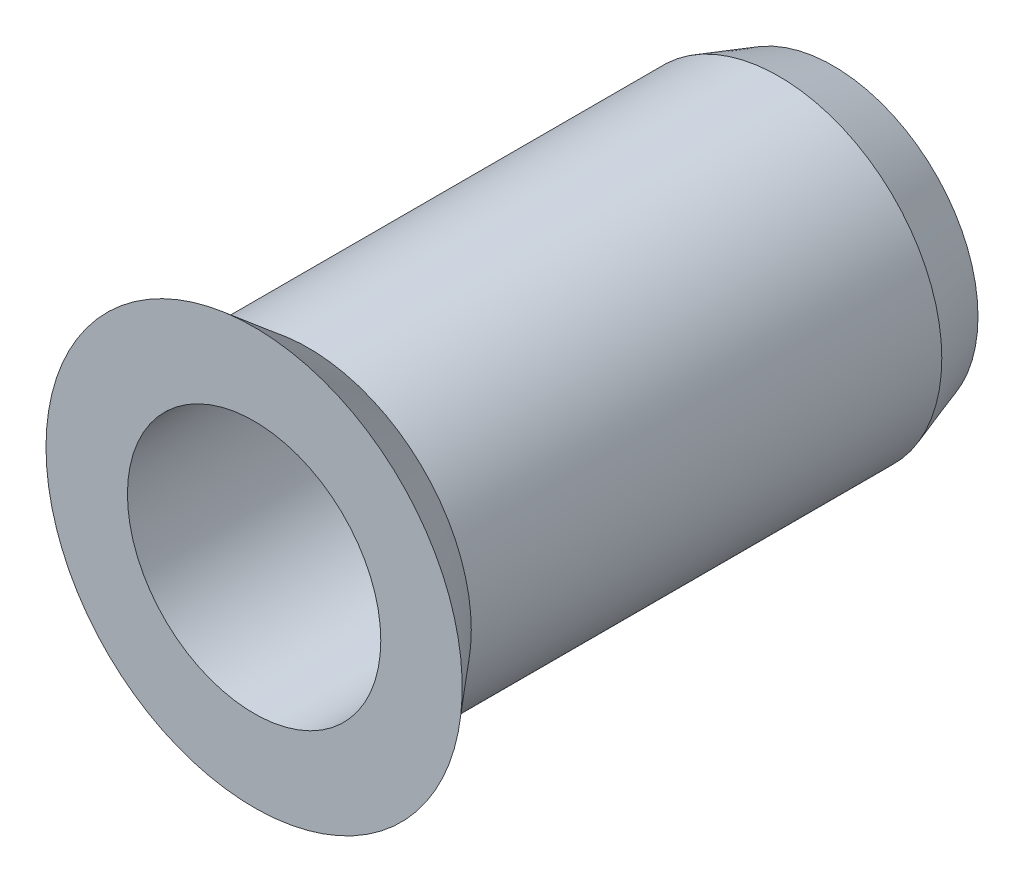
ISO-10303-21;
HEADER;
FILE_DESCRIPTION(('STEP AP214'),'2;1');
FILE_NAME('part.step','',(''),(''),'','','');
FILE_SCHEMA(('AUTOMOTIVE_DESIGN { 1 0 10303 214 1 1 1 1 }'));
ENDSEC;
DATA;
#1=APPLICATION_CONTEXT('core data for automotive mechanical design processes');
#2=APPLICATION_PROTOCOL_DEFINITION('international standard','automotive_design',2000,#1);
#3=PRODUCT_CONTEXT('',#1,'mechanical');
#4=PRODUCT('Part','Part','',(#3));
#5=PRODUCT_RELATED_PRODUCT_CATEGORY('part','',(#4));
#6=PRODUCT_DEFINITION_FORMATION('','',#4);
#7=PRODUCT_DEFINITION_CONTEXT('part definition',#1,'design');
#8=PRODUCT_DEFINITION('design','',#6,#7);
#9=PRODUCT_DEFINITION_SHAPE('','',#8);
#10=(LENGTH_UNIT() NAMED_UNIT(*) SI_UNIT(.MILLI.,.METRE.));
#11=(NAMED_UNIT(*) PLANE_ANGLE_UNIT() SI_UNIT($,.RADIAN.));
#12=(NAMED_UNIT(*) SI_UNIT($,.STERADIAN.) SOLID_ANGLE_UNIT());
#13=UNCERTAINTY_MEASURE_WITH_UNIT(LENGTH_MEASURE(1.E-05),#10,'distance_accuracy_value','');
#14=(GEOMETRIC_REPRESENTATION_CONTEXT(3) GLOBAL_UNCERTAINTY_ASSIGNED_CONTEXT((#13)) GLOBAL_UNIT_ASSIGNED_CONTEXT((#10,
#11,#12)) REPRESENTATION_CONTEXT('',''));
#15=CARTESIAN_POINT('',(0.,0.,0.));
#16=DIRECTION('',(0.,0.,1.));
#17=DIRECTION('',(1.,0.,0.));
#18=AXIS2_PLACEMENT_3D('',#15,#16,#17);
#19=CARTESIAN_POINT('',(0.,0.,16.0000000009859));
#20=DIRECTION('',(0.,0.,-1.));
#21=DIRECTION('',(-1.,0.,0.));
#22=AXIS2_PLACEMENT_3D('',#19,#20,#21);
#23=CYLINDRICAL_SURFACE('',#22,3.5);
#24=CARTESIAN_POINT('',(0.,0.,9.00000000000001));
#25=DIRECTION('',(0.,0.,-1.));
#26=DIRECTION('',(-1.,0.,0.));
#27=AXIS2_PLACEMENT_3D('',#24,#25,#26);
#28=CIRCLE('',#27,3.5);
#29=CARTESIAN_POINT('',(-3.5,0.,9.00000000000001));
#30=VERTEX_POINT('',#29);
#31=EDGE_CURVE('E10',#30,#30,#28,.T.);
#32=ORIENTED_EDGE('',*,*,#31,.T.);
#33=EDGE_LOOP('',(#32));
#34=FACE_BOUND('',#33,.T.);
#35=CARTESIAN_POINT('',(0.,0.,16.0000000020375));
#36=DIRECTION('',(0.,0.,-1.));
#37=DIRECTION('',(-1.,0.,0.));
#38=AXIS2_PLACEMENT_3D('',#35,#36,#37);
#39=CIRCLE('',#38,3.5);
#40=CARTESIAN_POINT('',(-3.5,0.,16.0000000020375));
#41=VERTEX_POINT('',#40);
#42=EDGE_CURVE('E65',#41,#41,#39,.T.);
#43=ORIENTED_EDGE('',*,*,#42,.F.);
#44=EDGE_LOOP('',(#43));
#45=FACE_BOUND('',#44,.T.);
#46=ADVANCED_FACE('F34',(#34,#45),#23,.F.);
#47=CARTESIAN_POINT('',(0.,0.,9.00000000000001));
#48=DIRECTION('',(0.,0.,1.));
#49=DIRECTION('',(1.,0.,0.));
#50=AXIS2_PLACEMENT_3D('',#47,#48,#49);
#51=CONICAL_SURFACE('',#50,3.5,1.02974425753921);
#52=CARTESIAN_POINT('',(0.,0.,8.39913937983283));
#53=DIRECTION('',(0.,0.,-1.));
#54=DIRECTION('',(-1.,0.,0.));
#55=AXIS2_PLACEMENT_3D('',#52,#53,#54);
#56=CIRCLE('',#55,2.50000000067985);
#57=CARTESIAN_POINT('',(-2.50000000067985,0.,8.39913937983283));
#58=VERTEX_POINT('',#57);
#59=EDGE_CURVE('E40',#58,#58,#56,.T.);
#60=ORIENTED_EDGE('',*,*,#59,.T.);
#61=EDGE_LOOP('',(#60));
#62=FACE_BOUND('',#61,.T.);
#63=ORIENTED_EDGE('',*,*,#31,.F.);
#64=EDGE_LOOP('',(#63));
#65=FACE_BOUND('',#64,.T.);
#66=ADVANCED_FACE('F73',(#62,#65),#51,.F.);
#67=CARTESIAN_POINT('',(0.,0.,16.0000000009859));
#68=DIRECTION('',(0.,0.,-1.));
#69=DIRECTION('',(-1.,0.,0.));
#70=AXIS2_PLACEMENT_3D('',#67,#68,#69);
#71=CYLINDRICAL_SURFACE('',#70,2.50000000067985);
#72=CARTESIAN_POINT('',(0.,0.,1.00000000088585));
#73=DIRECTION('',(0.,0.,-1.));
#74=DIRECTION('',(-1.,0.,0.));
#75=AXIS2_PLACEMENT_3D('',#72,#73,#74);
#76=CIRCLE('',#75,2.50000000067985);
#77=CARTESIAN_POINT('',(-2.50000000067985,0.,1.00000000088585));
#78=VERTEX_POINT('',#77);
#79=EDGE_CURVE('E44',#78,#78,#76,.T.);
#80=ORIENTED_EDGE('',*,*,#79,.T.);
#81=EDGE_LOOP('',(#80));
#82=FACE_BOUND('',#81,.T.);
#83=ORIENTED_EDGE('',*,*,#59,.F.);
#84=EDGE_LOOP('',(#83));
#85=FACE_BOUND('',#84,.T.);
#86=ADVANCED_FACE('F77',(#82,#85),#71,.F.);
#87=CARTESIAN_POINT('',(0.,0.,1.00000000088585));
#88=DIRECTION('',(0.,0.,-1.));
#89=DIRECTION('',(-1.,0.,0.));
#90=AXIS2_PLACEMENT_3D('',#87,#88,#89);
#91=CONICAL_SURFACE('',#90,2.50000000067985,0.785398163397448);
#92=CARTESIAN_POINT('',(0.,0.,8.81072992342524E-10));
#93=DIRECTION('',(0.,0.,-1.));
#94=DIRECTION('',(-1.,0.,0.));
#95=AXIS2_PLACEMENT_3D('',#92,#93,#94);
#96=CIRCLE('',#95,3.50000000068462);
#97=CARTESIAN_POINT('',(-3.50000000068462,0.,8.81072992342524E-10));
#98=VERTEX_POINT('',#97);
#99=EDGE_CURVE('E48',#98,#98,#96,.T.);
#100=ORIENTED_EDGE('',*,*,#99,.T.);
#101=EDGE_LOOP('',(#100));
#102=FACE_BOUND('',#101,.T.);
#103=ORIENTED_EDGE('',*,*,#79,.F.);
#104=EDGE_LOOP('',(#103));
#105=FACE_BOUND('',#104,.T.);
#106=ADVANCED_FACE('F81',(#102,#105),#91,.F.);
#107=CARTESIAN_POINT('',(3.50000000068462,0.,8.81072992342524E-10));
#108=DIRECTION('',(0.,0.,-1.));
#109=DIRECTION('',(-1.,0.,0.));
#110=AXIS2_PLACEMENT_3D('',#107,#108,#109);
#111=PLANE('',#110);
#112=CARTESIAN_POINT('',(0.,0.,8.81072992342524E-10));
#113=DIRECTION('',(0.,0.,-1.));
#114=DIRECTION('',(-1.,0.,0.));
#115=AXIS2_PLACEMENT_3D('',#112,#113,#114);
#116=CIRCLE('',#115,4.00000000130755);
#117=CARTESIAN_POINT('',(-4.00000000130755,0.,8.81072992342524E-10));
#118=VERTEX_POINT('',#117);
#119=EDGE_CURVE('E53',#118,#118,#116,.T.);
#120=ORIENTED_EDGE('',*,*,#119,.T.);
#121=EDGE_LOOP('',(#120));
#122=FACE_BOUND('',#121,.T.);
#123=ORIENTED_EDGE('',*,*,#99,.F.);
#124=EDGE_LOOP('',(#123));
#125=FACE_BOUND('',#124,.T.);
#126=ADVANCED_FACE('F88',(#122,#125),#111,.T.);
#127=CARTESIAN_POINT('',(0.,0.,8.81072992342524E-10));
#128=DIRECTION('',(0.,0.,1.));
#129=DIRECTION('',(1.,0.,0.));
#130=AXIS2_PLACEMENT_3D('',#127,#128,#129);
#131=CONICAL_SURFACE('',#130,4.00000000130755,0.321750554004332);
#132=CARTESIAN_POINT('',(0.,0.,1.5000000010516));
#133=DIRECTION('',(0.,0.,-1.));
#134=DIRECTION('',(-1.,0.,0.));
#135=AXIS2_PLACEMENT_3D('',#132,#133,#134);
#136=CIRCLE('',#135,4.50000000071054);
#137=CARTESIAN_POINT('',(-4.50000000071054,0.,1.5000000010516));
#138=VERTEX_POINT('',#137);
#139=EDGE_CURVE('E56',#138,#138,#136,.T.);
#140=ORIENTED_EDGE('',*,*,#139,.T.);
#141=EDGE_LOOP('',(#140));
#142=FACE_BOUND('',#141,.T.);
#143=ORIENTED_EDGE('',*,*,#119,.F.);
#144=EDGE_LOOP('',(#143));
#145=FACE_BOUND('',#144,.T.);
#146=ADVANCED_FACE('F92',(#142,#145),#131,.T.);
#147=CARTESIAN_POINT('',(0.,0.,16.0000000009859));
#148=DIRECTION('',(0.,0.,-1.));
#149=DIRECTION('',(-1.,0.,0.));
#150=AXIS2_PLACEMENT_3D('',#147,#148,#149);
#151=CYLINDRICAL_SURFACE('',#150,4.50000000071054);
#152=CARTESIAN_POINT('',(0.,0.,14.5000000010516));
#153=DIRECTION('',(0.,0.,-1.));
#154=DIRECTION('',(-1.,0.,0.));
#155=AXIS2_PLACEMENT_3D('',#152,#153,#154);
#156=CIRCLE('',#155,4.50000000071054);
#157=CARTESIAN_POINT('',(-4.50000000071054,0.,14.5000000010516));
#158=VERTEX_POINT('',#157);
#159=EDGE_CURVE('E59',#158,#158,#156,.T.);
#160=ORIENTED_EDGE('',*,*,#159,.T.);
#161=EDGE_LOOP('',(#160));
#162=FACE_BOUND('',#161,.T.);
#163=ORIENTED_EDGE('',*,*,#139,.F.);
#164=EDGE_LOOP('',(#163));
#165=FACE_BOUND('',#164,.T.);
#166=ADVANCED_FACE('F96',(#162,#165),#151,.T.);
#167=CARTESIAN_POINT('',(0.,0.,14.5000000010516));
#168=DIRECTION('',(0.,0.,1.));
#169=DIRECTION('',(1.,0.,0.));
#170=AXIS2_PLACEMENT_3D('',#167,#168,#169);
#171=CONICAL_SURFACE('',#170,4.50000000071054,0.6947382754174);
#172=CARTESIAN_POINT('',(0.,0.,16.0000000020375));
#173=DIRECTION('',(0.,0.,-1.));
#174=DIRECTION('',(-1.,0.,0.));
#175=AXIS2_PLACEMENT_3D('',#172,#173,#174);
#176=CIRCLE('',#175,5.74999999955139);
#177=CARTESIAN_POINT('',(-5.74999999955139,0.,16.0000000020375));
#178=VERTEX_POINT('',#177);
#179=EDGE_CURVE('E62',#178,#178,#176,.T.);
#180=ORIENTED_EDGE('',*,*,#179,.T.);
#181=EDGE_LOOP('',(#180));
#182=FACE_BOUND('',#181,.T.);
#183=ORIENTED_EDGE('',*,*,#159,.F.);
#184=EDGE_LOOP('',(#183));
#185=FACE_BOUND('',#184,.T.);
#186=ADVANCED_FACE('F100',(#182,#185),#171,.T.);
#187=CARTESIAN_POINT('',(5.74999999955139,0.,16.0000000020375));
#188=DIRECTION('',(0.,0.,1.));
#189=DIRECTION('',(1.,0.,0.));
#190=AXIS2_PLACEMENT_3D('',#187,#188,#189);
#191=PLANE('',#190);
#192=ORIENTED_EDGE('',*,*,#42,.T.);
#193=EDGE_LOOP('',(#192));
#194=FACE_BOUND('',#193,.T.);
#195=ORIENTED_EDGE('',*,*,#179,.F.);
#196=EDGE_LOOP('',(#195));
#197=FACE_BOUND('',#196,.T.);
#198=ADVANCED_FACE('F69',(#194,#197),#191,.T.);
#199=CLOSED_SHELL('',(#46,#66,#86,#106,#126,#146,#166,#186,#198));
#200=MANIFOLD_SOLID_BREP('B2',#199);
#201=ADVANCED_BREP_SHAPE_REPRESENTATION('',(#18,#200),#14);
#202=SHAPE_DEFINITION_REPRESENTATION(#9,#201);
ENDSEC;
END-ISO-10303-21;
